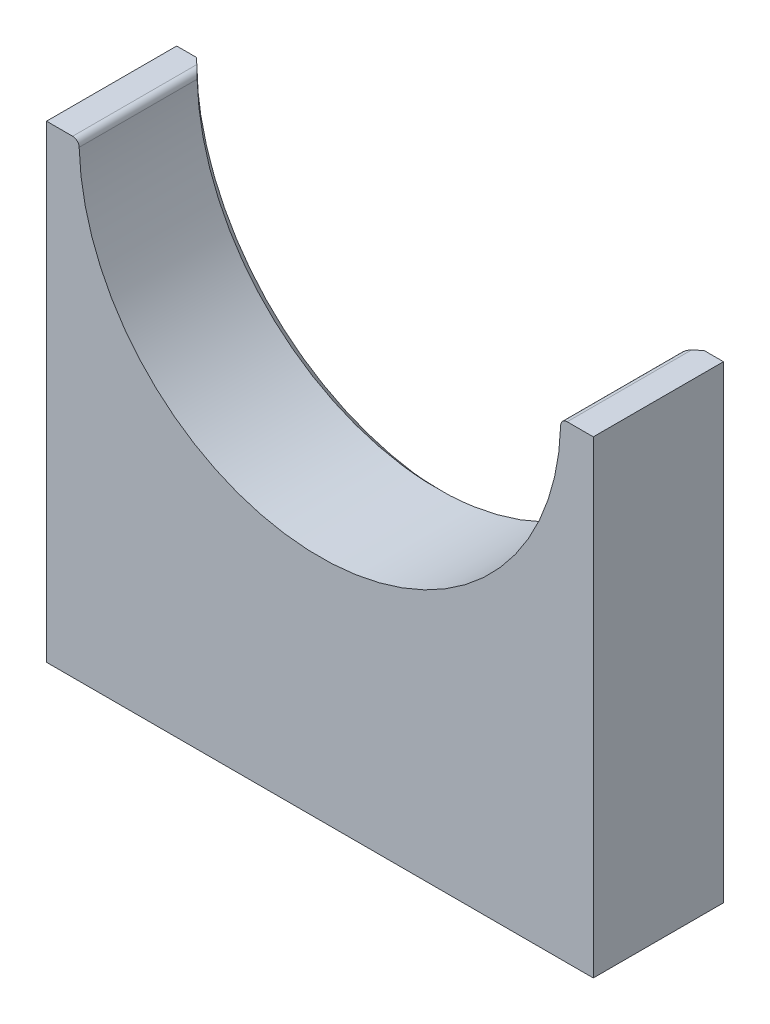
ISO-10303-21;
HEADER;
FILE_DESCRIPTION(('STEP AP214'),'2;1');
FILE_NAME('part.step','',(''),(''),'','','');
FILE_SCHEMA(('AUTOMOTIVE_DESIGN { 1 0 10303 214 1 1 1 1 }'));
ENDSEC;
DATA;
#1=APPLICATION_CONTEXT('core data for automotive mechanical design processes');
#2=APPLICATION_PROTOCOL_DEFINITION('international standard','automotive_design',2000,#1);
#3=PRODUCT_CONTEXT('',#1,'mechanical');
#4=PRODUCT('Part','Part','',(#3));
#5=PRODUCT_RELATED_PRODUCT_CATEGORY('part','',(#4));
#6=PRODUCT_DEFINITION_FORMATION('','',#4);
#7=PRODUCT_DEFINITION_CONTEXT('part definition',#1,'design');
#8=PRODUCT_DEFINITION('design','',#6,#7);
#9=PRODUCT_DEFINITION_SHAPE('','',#8);
#10=(LENGTH_UNIT() NAMED_UNIT(*) SI_UNIT(.MILLI.,.METRE.));
#11=(NAMED_UNIT(*) PLANE_ANGLE_UNIT() SI_UNIT($,.RADIAN.));
#12=(NAMED_UNIT(*) SI_UNIT($,.STERADIAN.) SOLID_ANGLE_UNIT());
#13=UNCERTAINTY_MEASURE_WITH_UNIT(LENGTH_MEASURE(1.E-05),#10,'distance_accuracy_value','');
#14=(GEOMETRIC_REPRESENTATION_CONTEXT(3) GLOBAL_UNCERTAINTY_ASSIGNED_CONTEXT((#13)) GLOBAL_UNIT_ASSIGNED_CONTEXT((#10,
#11,#12)) REPRESENTATION_CONTEXT('',''));
#15=CARTESIAN_POINT('',(0.,0.,0.));
#16=DIRECTION('',(0.,0.,1.));
#17=DIRECTION('',(1.,0.,0.));
#18=AXIS2_PLACEMENT_3D('',#15,#16,#17);
#19=CARTESIAN_POINT('',(106.68,-106.68,0.));
#20=DIRECTION('',(1.,0.,0.));
#21=DIRECTION('',(0.,0.,-1.));
#22=AXIS2_PLACEMENT_3D('',#19,#20,#21);
#23=PLANE('',#22);
#24=DIRECTION('',(0.,0.,-1.));
#25=VECTOR('',#24,1.);
#26=CARTESIAN_POINT('',(106.68,0.,0.));
#27=LINE('',#26,#25);
#28=CARTESIAN_POINT('',(106.68,0.,50.8));
#29=VERTEX_POINT('',#28);
#30=CARTESIAN_POINT('',(106.68,0.,0.));
#31=VERTEX_POINT('',#30);
#32=EDGE_CURVE('E120',#29,#31,#27,.T.);
#33=ORIENTED_EDGE('',*,*,#32,.F.);
#34=DIRECTION('',(0.,1.,0.));
#35=VECTOR('',#34,1.);
#36=CARTESIAN_POINT('',(106.68,-106.68,50.8));
#37=LINE('',#36,#35);
#38=CARTESIAN_POINT('',(106.68,-182.88,50.8));
#39=VERTEX_POINT('',#38);
#40=EDGE_CURVE('E115',#39,#29,#37,.T.);
#41=ORIENTED_EDGE('',*,*,#40,.F.);
#42=DIRECTION('',(0.,0.,1.));
#43=VECTOR('',#42,1.);
#44=CARTESIAN_POINT('',(106.68,-182.88,50.8));
#45=LINE('',#44,#43);
#46=CARTESIAN_POINT('',(106.68,-182.88,0.));
#47=VERTEX_POINT('',#46);
#48=EDGE_CURVE('E119',#47,#39,#45,.T.);
#49=ORIENTED_EDGE('',*,*,#48,.F.);
#50=DIRECTION('',(0.,1.,0.));
#51=VECTOR('',#50,1.);
#52=CARTESIAN_POINT('',(106.68,-106.68,0.));
#53=LINE('',#52,#51);
#54=EDGE_CURVE('E266',#47,#31,#53,.T.);
#55=ORIENTED_EDGE('',*,*,#54,.T.);
#56=EDGE_LOOP('',(#33,#41,#49,#55));
#57=FACE_BOUND('',#56,.T.);
#58=ADVANCED_FACE('F41',(#57),#23,.T.);
#59=CARTESIAN_POINT('',(-106.68,-106.68,0.));
#60=DIRECTION('',(-1.,0.,0.));
#61=DIRECTION('',(0.,0.,1.));
#62=AXIS2_PLACEMENT_3D('',#59,#60,#61);
#63=PLANE('',#62);
#64=DIRECTION('',(0.,0.,1.));
#65=VECTOR('',#64,1.);
#66=CARTESIAN_POINT('',(-106.68,0.,0.));
#67=LINE('',#66,#65);
#68=CARTESIAN_POINT('',(-106.68,0.,0.));
#69=VERTEX_POINT('',#68);
#70=CARTESIAN_POINT('',(-106.68,0.,50.8));
#71=VERTEX_POINT('',#70);
#72=EDGE_CURVE('E164',#69,#71,#67,.T.);
#73=ORIENTED_EDGE('',*,*,#72,.F.);
#74=DIRECTION('',(0.,-1.,0.));
#75=VECTOR('',#74,1.);
#76=CARTESIAN_POINT('',(-106.68,-106.68,0.));
#77=LINE('',#76,#75);
#78=CARTESIAN_POINT('',(-106.68,-182.88,0.));
#79=VERTEX_POINT('',#78);
#80=EDGE_CURVE('E268',#69,#79,#77,.T.);
#81=ORIENTED_EDGE('',*,*,#80,.T.);
#82=DIRECTION('',(0.,0.,-1.));
#83=VECTOR('',#82,1.);
#84=CARTESIAN_POINT('',(-106.68,-182.88,50.8));
#85=LINE('',#84,#83);
#86=CARTESIAN_POINT('',(-106.68,-182.88,50.8));
#87=VERTEX_POINT('',#86);
#88=EDGE_CURVE('E136',#87,#79,#85,.T.);
#89=ORIENTED_EDGE('',*,*,#88,.F.);
#90=DIRECTION('',(0.,-1.,0.));
#91=VECTOR('',#90,1.);
#92=CARTESIAN_POINT('',(-106.68,-106.68,50.8));
#93=LINE('',#92,#91);
#94=EDGE_CURVE('E124',#71,#87,#93,.T.);
#95=ORIENTED_EDGE('',*,*,#94,.F.);
#96=EDGE_LOOP('',(#73,#81,#89,#95));
#97=FACE_BOUND('',#96,.T.);
#98=ADVANCED_FACE('F241',(#97),#63,.T.);
#99=CARTESIAN_POINT('',(0.,0.,0.));
#100=DIRECTION('',(0.,0.,-1.));
#101=DIRECTION('',(-1.,0.,0.));
#102=AXIS2_PLACEMENT_3D('',#99,#100,#101);
#103=PLANE('',#102);
#104=DIRECTION('',(-1.,0.,0.));
#105=VECTOR('',#104,1.);
#106=CARTESIAN_POINT('',(0.,0.,0.));
#107=LINE('',#106,#105);
#108=CARTESIAN_POINT('',(99.060000898988,8.4741096414025E-12,0.));
#109=VERTEX_POINT('',#108);
#110=EDGE_CURVE('E152',#31,#109,#107,.T.);
#111=ORIENTED_EDGE('',*,*,#110,.F.);
#112=ORIENTED_EDGE('',*,*,#54,.F.);
#113=DIRECTION('',(1.,0.,0.));
#114=VECTOR('',#113,1.);
#115=CARTESIAN_POINT('',(106.68,-182.88,0.));
#116=LINE('',#115,#114);
#117=EDGE_CURVE('E141',#79,#47,#116,.T.);
#118=ORIENTED_EDGE('',*,*,#117,.F.);
#119=ORIENTED_EDGE('',*,*,#80,.F.);
#120=CARTESIAN_POINT('',(-99.06,0.,0.));
#121=VERTEX_POINT('',#120);
#122=EDGE_CURVE('E161',#121,#69,#107,.T.);
#123=ORIENTED_EDGE('',*,*,#122,.F.);
#124=CARTESIAN_POINT('',(0.,0.,0.));
#125=DIRECTION('',(0.,0.,1.));
#126=DIRECTION('',(1.,0.,0.));
#127=AXIS2_PLACEMENT_3D('',#124,#125,#126);
#128=CIRCLE('',#127,99.06);
#129=EDGE_CURVE('E168',#121,#109,#128,.T.);
#130=ORIENTED_EDGE('',*,*,#129,.T.);
#131=EDGE_LOOP('',(#111,#112,#118,#119,#123,#130));
#132=FACE_BOUND('',#131,.T.);
#133=ADVANCED_FACE('F244',(#132),#103,.T.);
#134=CARTESIAN_POINT('',(0.,0.,50.8));
#135=DIRECTION('',(0.,0.,-1.));
#136=DIRECTION('',(-1.,0.,0.));
#137=AXIS2_PLACEMENT_3D('',#134,#135,#136);
#138=PLANE('',#137);
#139=CARTESIAN_POINT('',(0.,0.,50.8));
#140=DIRECTION('',(0.,0.,1.));
#141=DIRECTION('',(1.,0.,0.));
#142=AXIS2_PLACEMENT_3D('',#139,#140,#141);
#143=CIRCLE('',#142,93.98);
#144=CARTESIAN_POINT('',(-93.9474528128767,-2.47315789473684,50.8));
#145=VERTEX_POINT('',#144);
#146=CARTESIAN_POINT('',(93.9474528128767,-2.47315789473684,50.8));
#147=VERTEX_POINT('',#146);
#148=EDGE_CURVE('E125',#145,#147,#143,.T.);
#149=ORIENTED_EDGE('',*,*,#148,.F.);
#150=CARTESIAN_POINT('',(-96.4865731591707,-2.54,50.8));
#151=DIRECTION('',(0.,0.,-1.));
#152=DIRECTION('',(-1.,0.,0.));
#153=AXIS2_PLACEMENT_3D('',#150,#151,#152);
#154=CIRCLE('',#153,2.54);
#155=CARTESIAN_POINT('',(-96.4865731591707,0.,50.8));
#156=VERTEX_POINT('',#155);
#157=EDGE_CURVE('E294',#145,#156,#154,.F.);
#158=ORIENTED_EDGE('',*,*,#157,.T.);
#159=DIRECTION('',(-1.,0.,0.));
#160=VECTOR('',#159,1.);
#161=CARTESIAN_POINT('',(0.,0.,50.8));
#162=LINE('',#161,#160);
#163=EDGE_CURVE('E153',#156,#71,#162,.T.);
#164=ORIENTED_EDGE('',*,*,#163,.T.);
#165=ORIENTED_EDGE('',*,*,#94,.T.);
#166=DIRECTION('',(-1.,0.,0.));
#167=VECTOR('',#166,1.);
#168=CARTESIAN_POINT('',(106.68,-182.88,50.8));
#169=LINE('',#168,#167);
#170=EDGE_CURVE('E128',#39,#87,#169,.T.);
#171=ORIENTED_EDGE('',*,*,#170,.F.);
#172=ORIENTED_EDGE('',*,*,#40,.T.);
#173=CARTESIAN_POINT('',(96.4865731591707,0.,50.8));
#174=VERTEX_POINT('',#173);
#175=EDGE_CURVE('E149',#29,#174,#162,.T.);
#176=ORIENTED_EDGE('',*,*,#175,.T.);
#177=CARTESIAN_POINT('',(96.4865731591707,-2.54,50.8));
#178=DIRECTION('',(0.,0.,-1.));
#179=DIRECTION('',(-1.,0.,0.));
#180=AXIS2_PLACEMENT_3D('',#177,#178,#179);
#181=CIRCLE('',#180,2.54);
#182=EDGE_CURVE('E284',#174,#147,#181,.F.);
#183=ORIENTED_EDGE('',*,*,#182,.T.);
#184=EDGE_LOOP('',(#149,#158,#164,#165,#171,#172,#176,#183));
#185=FACE_BOUND('',#184,.T.);
#186=ADVANCED_FACE('F130',(#185),#138,.F.);
#187=CARTESIAN_POINT('',(0.,0.,0.));
#188=DIRECTION('',(0.,0.,1.));
#189=DIRECTION('',(1.,0.,0.));
#190=AXIS2_PLACEMENT_3D('',#187,#188,#189);
#191=CYLINDRICAL_SURFACE('',#190,93.98);
#192=CARTESIAN_POINT('',(0.,0.,4.77022595576423));
#193=DIRECTION('',(0.,0.,1.));
#194=DIRECTION('',(1.,0.,0.));
#195=AXIS2_PLACEMENT_3D('',#192,#193,#194);
#196=CIRCLE('',#195,93.98);
#197=CARTESIAN_POINT('',(93.9474528128767,-2.47315789473684,4.77022595576423));
#198=VERTEX_POINT('',#197);
#199=CARTESIAN_POINT('',(-93.9474528128767,-2.47315789473684,4.77022595576423));
#200=VERTEX_POINT('',#199);
#201=EDGE_CURVE('E261',#198,#200,#196,.F.);
#202=ORIENTED_EDGE('',*,*,#201,.T.);
#203=DIRECTION('',(0.,0.,1.));
#204=VECTOR('',#203,1.);
#205=CARTESIAN_POINT('',(-93.9474528128767,-2.47315789473684,0.));
#206=LINE('',#205,#204);
#207=EDGE_CURVE('E280',#200,#145,#206,.T.);
#208=ORIENTED_EDGE('',*,*,#207,.T.);
#209=ORIENTED_EDGE('',*,*,#148,.T.);
#210=DIRECTION('',(0.,0.,1.));
#211=VECTOR('',#210,1.);
#212=CARTESIAN_POINT('',(93.9474528128767,-2.47315789473684,0.));
#213=LINE('',#212,#211);
#214=EDGE_CURVE('E278',#147,#198,#213,.F.);
#215=ORIENTED_EDGE('',*,*,#214,.T.);
#216=EDGE_LOOP('',(#202,#208,#209,#215));
#217=FACE_BOUND('',#216,.T.);
#218=ADVANCED_FACE('F191',(#217),#191,.F.);
#219=CARTESIAN_POINT('',(-5.22583665885806,98.9220613979255,0.));
#220=CARTESIAN_POINT('',(82.0692055030363,45.7917668156667,50.8));
#221=CARTESIAN_POINT('',(-203.069959454709,88.4703880802093,0.));
#222=CARTESIAN_POINT('',(-9.51432812829715,209.930177821739,50.8));
#223=CARTESIAN_POINT('',(-192.618286136993,-109.373734715642,0.));
#224=CARTESIAN_POINT('',(-173.65273913437,118.346644190406,50.8));
#225=CARTESIAN_POINT('',(5.22583665885805,-98.9220613979255,0.));
#226=CARTESIAN_POINT('',(-82.0692055030363,-45.7917668156667,50.8));
#227=CARTESIAN_POINT('',(203.069959454709,-88.4703880802094,0.));
#228=CARTESIAN_POINT('',(9.51432812829715,-209.930177821739,50.8));
#229=CARTESIAN_POINT('',(192.618286136993,109.373734715642,0.));
#230=CARTESIAN_POINT('',(173.65273913437,-118.346644190406,50.8));
#231=CARTESIAN_POINT('',(-5.22583665885806,98.9220613979255,0.));
#232=CARTESIAN_POINT('',(82.0692055030363,45.7917668156667,50.8));
#233=(BOUNDED_SURFACE() B_SPLINE_SURFACE(3,1,((#219,#220),(#221,#222),(#223,#224),(#225,#226),
(#227,#228),(#229,#230),(#231,#232)),.UNSPECIFIED.,.T.,.F.,.F.) B_SPLINE_SURFACE_WITH_KNOTS((4,
3,4),(2,2),(0.,0.5,1.),(0.,1.),
.UNSPECIFIED.) GEOMETRIC_REPRESENTATION_ITEM() RATIONAL_B_SPLINE_SURFACE(((1.,1.),
(0.333333333333333,0.333333333333333),(0.333333333333333,0.333333333333333),(1.,1.),
(0.333333333333333,0.333333333333333),(0.333333333333333,0.333333333333333),(1.,1.))) REPRESENTATION_ITEM('') SURFACE());
#234=CARTESIAN_POINT('',(-99.06,0.,0.));
#235=CARTESIAN_POINT('',(-98.8420415564241,0.,0.192023565351599));
#236=CARTESIAN_POINT('',(-98.6247542611355,0.,0.384810081436057));
#237=CARTESIAN_POINT('',(-98.191641019553,0.,0.771931527221112));
#238=CARTESIAN_POINT('',(-97.9758147922164,0.,0.966266142524899));
#239=CARTESIAN_POINT('',(-97.5456871295782,0.,1.35655437710607));
#240=CARTESIAN_POINT('',(-97.3313854801418,0.,1.552507760316));
#241=CARTESIAN_POINT('',(-96.904376188475,0.,1.94610967369235));
#242=CARTESIAN_POINT('',(-96.6916684191595,0.,2.14375806595662));
#243=CARTESIAN_POINT('',(-96.2679132721635,0.,2.54083784763829));
#244=CARTESIAN_POINT('',(-96.0568659359386,0.,2.7402692813086));
#245=CARTESIAN_POINT('',(-95.6365205364005,0.,3.14099307641488));
#246=CARTESIAN_POINT('',(-95.4272225801195,0.,3.34228555015067));
#247=CARTESIAN_POINT('',(-95.0104629208144,0.,3.7468214264179));
#248=CARTESIAN_POINT('',(-94.8030014789203,0.,3.95006509808633));
#249=CARTESIAN_POINT('',(-94.3900106012508,0.,4.35860085026798));
#250=CARTESIAN_POINT('',(-94.1844816240633,0.,4.56389339429799));
#251=CARTESIAN_POINT('',(-93.98,0.,4.77022595576423));
#252=B_SPLINE_CURVE_WITH_KNOTS('',3,(#234,#235,#236,#237,#238,#239,#240,#241,#242,#243,#244,
#245,#246,#247,#248,#249,#250,#251),.UNSPECIFIED.,.F.,.F.,(4,2,2,2,2,2,2,2,4),(0.,
0.871440911790066,1.742709142632,2.61385248247416,3.48492560799787,4.35602041284292,
5.2271681293328,6.0984377845629,6.96990922896814),.UNSPECIFIED.);
#253=CARTESIAN_POINT('',(-96.4865731591707,0.,2.33594315915091));
#254=VERTEX_POINT('',#253);
#255=EDGE_CURVE('E286',#121,#254,#252,.T.);
#256=CARTESIAN_POINT('',(-96.4865731591707,0.,2.33594315915092));
#257=CARTESIAN_POINT('',(-96.3907783816814,-2.28734198966048E-05,2.4256863367287));
#258=CARTESIAN_POINT('',(-96.2951557438185,-0.0054204631764299,2.51561959757531));
#259=CARTESIAN_POINT('',(-96.1048050487047,-0.0270198857876057,2.69532843631234));
#260=CARTESIAN_POINT('',(-96.0100780027566,-0.0432327268632509,2.78510376000471));
#261=CARTESIAN_POINT('',(-95.82142662309,-0.0867112280092524,2.96457256375114));
#262=CARTESIAN_POINT('',(-95.7275170525504,-0.114074473477392,3.05425812613927));
#263=CARTESIAN_POINT('',(-95.5421671763655,-0.180048708924797,3.23191646792834));
#264=CARTESIAN_POINT('',(-95.4507256393181,-0.218653972050118,3.31989009513243));
#265=CARTESIAN_POINT('',(-95.228172826037,-0.328672477694684,3.53472248905243));
#266=CARTESIAN_POINT('',(-95.0989425252194,-0.406951492065627,3.66011496173031));
#267=CARTESIAN_POINT('',(-94.8513966790954,-0.590275246293499,3.901204769233));
#268=CARTESIAN_POINT('',(-94.7330468498244,-0.695231694108387,4.01693244392788));
#269=CARTESIAN_POINT('',(-94.5427887194575,-0.90075882838026,4.20320576014691));
#270=CARTESIAN_POINT('',(-94.4670929117637,-0.994502611456122,4.27739118243087));
#271=CARTESIAN_POINT('',(-94.3268837415952,-1.19742865543148,4.41458235847555));
#272=CARTESIAN_POINT('',(-94.2623585958944,-1.30659442509418,4.47759989421689));
#273=CARTESIAN_POINT('',(-94.1599755272071,-1.51570466255616,4.5769383728503));
#274=CARTESIAN_POINT('',(-94.119362463698,-1.61294669783869,4.61608392750956));
#275=CARTESIAN_POINT('',(-94.0498143344169,-1.8153035925336,4.68226696532161));
#276=CARTESIAN_POINT('',(-94.0208522919404,-1.92039958944052,4.70933243474053));
#277=CARTESIAN_POINT('',(-93.9837881747674,-2.10052418485804,4.74275839186404));
#278=CARTESIAN_POINT('',(-93.9719587380808,-2.17408404923659,4.75300012445085));
#279=CARTESIAN_POINT('',(-93.9590740429289,-2.28553245291593,4.76330435891457));
#280=CARTESIAN_POINT('',(-93.9555874502478,-2.32292512996336,4.76589611518262));
#281=CARTESIAN_POINT('',(-93.9502707809998,-2.3979210806584,4.76935845340214));
#282=CARTESIAN_POINT('',(-93.9484413153444,-2.43552442683455,4.77022840073645));
#283=CARTESIAN_POINT('',(-93.9474528128768,-2.47315789473685,4.77022595576424));
#284=B_SPLINE_CURVE_WITH_KNOTS('',3,(#256,#257,#258,#259,#260,#261,#262,#263,#264,#265,#266,
#267,#268,#269,#270,#271,#272,#273,#274,#275,#276,#277,#278,#279,#280,#281,#282,#283),
.UNSPECIFIED.,.F.,.F.,(4,2,2,2,2,2,2,2,2,2,2,2,2,4),(0.,0.393691183311433,0.787783694854728,
1.18540191939596,1.58281794447385,2.16978336088005,2.75483088320148,3.1779448337119,
3.60060971197725,3.93656756447468,4.27174300205018,4.49677265923884,4.60963563127643,
4.72254019413725),.UNSPECIFIED.);
#285=EDGE_CURVE('E51',#254,#200,#284,.T.);
#286=CARTESIAN_POINT('',(93.9474528128767,-2.47315789473684,4.77022595576423));
#287=CARTESIAN_POINT('',(93.9489291401898,-2.41651911682494,4.77024218393827));
#288=CARTESIAN_POINT('',(93.9523290599421,-2.35994312111087,4.76826189081975));
#289=CARTESIAN_POINT('',(93.9628484133792,-2.24745641307316,4.76043328936199));
#290=CARTESIAN_POINT('',(93.9699645789687,-2.19154516028355,4.75458837839779));
#291=CARTESIAN_POINT('',(93.9877104386483,-2.08133167085285,4.73922558560946));
#292=CARTESIAN_POINT('',(93.9983074772912,-2.02701940710691,4.72974170836603));
#293=CARTESIAN_POINT('',(94.0228194227348,-1.9198858562407,4.70732000686794));
#294=CARTESIAN_POINT('',(94.036734877778,-1.86706481710315,4.69438161184296));
#295=CARTESIAN_POINT('',(94.0830007413739,-1.71171423567033,4.65085893163281));
#296=CARTESIAN_POINT('',(94.1199488683891,-1.61182945713453,4.6154986834326));
#297=CARTESIAN_POINT('',(94.2040026290788,-1.42088262943083,4.53431734624686));
#298=CARTESIAN_POINT('',(94.2511333277324,-1.32984316990191,4.48847042707676));
#299=CARTESIAN_POINT('',(94.3759005534837,-1.11963986223858,4.36670398851872));
#300=CARTESIAN_POINT('',(94.4578658573818,-1.00557987745164,4.28639973708225));
#301=CARTESIAN_POINT('',(94.6337293162669,-0.797232154888076,4.11415452586312));
#302=CARTESIAN_POINT('',(94.7276504756688,-0.702983488580931,4.0221911340007));
#303=CARTESIAN_POINT('',(94.9614639032409,-0.500938167908489,3.79385283366979));
#304=CARTESIAN_POINT('',(95.1052325718967,-0.401672116667926,3.65391155073541));
#305=CARTESIAN_POINT('',(95.4030688562071,-0.236375634609102,3.36565026919413));
#306=CARTESIAN_POINT('',(95.557151569847,-0.170395188969929,3.2173180391234));
#307=CARTESIAN_POINT('',(95.8405567685684,-0.0799606386701698,2.94624295942536));
#308=CARTESIAN_POINT('',(95.968793307193,-0.0498934552733968,2.82420092906747));
#309=CARTESIAN_POINT('',(96.1624414085361,-0.0199256720264858,2.64087877685973));
#310=CARTESIAN_POINT('',(96.2270327028884,-0.0124585234292448,2.57989087722398));
#311=CARTESIAN_POINT('',(96.3565765625072,-0.00249844768752199,2.45789198706339));
#312=CARTESIAN_POINT('',(96.4215291289541,-5.53680555431266E-06,2.39688099646371));
#313=CARTESIAN_POINT('',(96.4865731591707,0.,2.3359431591509));
#314=B_SPLINE_CURVE_WITH_KNOTS('',3,(#286,#287,#288,#289,#290,#291,#292,#293,#294,#295,#296,
#297,#298,#299,#300,#301,#302,#303,#304,#305,#306,#307,#308,#309,#310,#311,#312,#313),
.UNSPECIFIED.,.F.,.F.,(4,2,2,2,2,2,2,2,2,2,2,2,2,4),(0.,0.16988757443849,0.339625999386691,
0.507815469529214,0.676032745875542,1.01104920888532,1.34689992569336,1.82957292463732,
2.31318909060348,2.98115557737312,3.65012218923543,4.18760227381058,4.45492303214249,
4.72224466443755),.UNSPECIFIED.);
#315=CARTESIAN_POINT('',(96.4865731591707,0.,2.33594315915089));
#316=VERTEX_POINT('',#315);
#317=EDGE_CURVE('E58',#198,#316,#314,.T.);
#318=CARTESIAN_POINT('',(93.98,0.,4.77022595576422));
#319=CARTESIAN_POINT('',(94.1844816240634,0.,4.56389339429798));
#320=CARTESIAN_POINT('',(94.3900106012509,0.,4.35860085026797));
#321=CARTESIAN_POINT('',(94.8030014789203,0.,3.95006509808631));
#322=CARTESIAN_POINT('',(95.0104629208144,0.,3.74682142641787));
#323=CARTESIAN_POINT('',(95.4272225801195,0.,3.34228555015063));
#324=CARTESIAN_POINT('',(95.6365205364005,0.,3.14099307641486));
#325=CARTESIAN_POINT('',(96.0568659359386,0.,2.74026928130858));
#326=CARTESIAN_POINT('',(96.2679132721635,0.,2.54083784763825));
#327=CARTESIAN_POINT('',(96.6916684191595,0.,2.14375806595659));
#328=CARTESIAN_POINT('',(96.9043761884749,0.,1.94610967369234));
#329=CARTESIAN_POINT('',(97.3313854801418,0.,1.552507760316));
#330=CARTESIAN_POINT('',(97.5456871295782,0.,1.35655437710608));
#331=CARTESIAN_POINT('',(97.9758147922163,0.,0.966266142524903));
#332=CARTESIAN_POINT('',(98.1916410195529,0.,0.771931527221111));
#333=CARTESIAN_POINT('',(98.6247542611355,0.,0.384810081436048));
#334=CARTESIAN_POINT('',(98.842041556424,0.,0.192023565351587));
#335=CARTESIAN_POINT('',(99.06,0.,0.));
#336=B_SPLINE_CURVE_WITH_KNOTS('',3,(#318,#319,#320,#321,#322,#323,#324,#325,#326,#327,#328,
#329,#330,#331,#332,#333,#334,#335),.UNSPECIFIED.,.F.,.F.,(4,2,2,2,2,2,2,2,4),(0.,
0.87147144440522,1.74274109963534,2.6138888161252,3.48498362097025,4.35605674649394,
5.22720008633611,6.09846831717803,6.96990922896811),.UNSPECIFIED.);
#337=EDGE_CURVE('E226',#316,#109,#336,.T.);
#338=ORIENTED_EDGE('',*,*,#255,.T.);
#339=ORIENTED_EDGE('',*,*,#285,.T.);
#340=ORIENTED_EDGE('',*,*,#201,.F.);
#341=ORIENTED_EDGE('',*,*,#317,.T.);
#342=ORIENTED_EDGE('',*,*,#337,.T.);
#343=ORIENTED_EDGE('',*,*,#129,.F.);
#344=EDGE_LOOP('',(#338,#339,#340,#341,#342,#343));
#345=FACE_BOUND('',#344,.T.);
#346=ADVANCED_FACE('F178',(#345),#233,.F.);
#347=CARTESIAN_POINT('',(0.,0.,0.));
#348=DIRECTION('',(0.,-1.,0.));
#349=DIRECTION('',(0.,0.,-1.));
#350=AXIS2_PLACEMENT_3D('',#347,#348,#349);
#351=PLANE('',#350);
#352=ORIENTED_EDGE('',*,*,#337,.F.);
#353=DIRECTION('',(0.,0.,1.));
#354=VECTOR('',#353,1.);
#355=CARTESIAN_POINT('',(96.4865731591707,0.,0.));
#356=LINE('',#355,#354);
#357=EDGE_CURVE('E12',#316,#174,#356,.T.);
#358=ORIENTED_EDGE('',*,*,#357,.T.);
#359=ORIENTED_EDGE('',*,*,#175,.F.);
#360=ORIENTED_EDGE('',*,*,#32,.T.);
#361=ORIENTED_EDGE('',*,*,#110,.T.);
#362=EDGE_LOOP('',(#352,#358,#359,#360,#361));
#363=FACE_BOUND('',#362,.T.);
#364=ADVANCED_FACE('F190',(#363),#351,.F.);
#365=ORIENTED_EDGE('',*,*,#163,.F.);
#366=DIRECTION('',(0.,0.,1.));
#367=VECTOR('',#366,1.);
#368=CARTESIAN_POINT('',(-96.4865731591707,0.,0.));
#369=LINE('',#368,#367);
#370=EDGE_CURVE('E66',#156,#254,#369,.F.);
#371=ORIENTED_EDGE('',*,*,#370,.T.);
#372=ORIENTED_EDGE('',*,*,#255,.F.);
#373=ORIENTED_EDGE('',*,*,#122,.T.);
#374=ORIENTED_EDGE('',*,*,#72,.T.);
#375=EDGE_LOOP('',(#365,#371,#372,#373,#374));
#376=FACE_BOUND('',#375,.T.);
#377=ADVANCED_FACE('F237',(#376),#351,.F.);
#378=CARTESIAN_POINT('',(-96.4865731591707,-2.54,0.));
#379=DIRECTION('',(0.,0.,1.));
#380=DIRECTION('',(1.,0.,0.));
#381=AXIS2_PLACEMENT_3D('',#378,#379,#380);
#382=CYLINDRICAL_SURFACE('',#381,2.54);
#383=ORIENTED_EDGE('',*,*,#285,.F.);
#384=ORIENTED_EDGE('',*,*,#370,.F.);
#385=ORIENTED_EDGE('',*,*,#157,.F.);
#386=ORIENTED_EDGE('',*,*,#207,.F.);
#387=EDGE_LOOP('',(#383,#384,#385,#386));
#388=FACE_BOUND('',#387,.T.);
#389=ADVANCED_FACE('F233',(#388),#382,.T.);
#390=CARTESIAN_POINT('',(96.4865731591707,-2.54,0.));
#391=DIRECTION('',(0.,0.,1.));
#392=DIRECTION('',(1.,0.,0.));
#393=AXIS2_PLACEMENT_3D('',#390,#391,#392);
#394=CYLINDRICAL_SURFACE('',#393,2.54);
#395=ORIENTED_EDGE('',*,*,#182,.F.);
#396=ORIENTED_EDGE('',*,*,#357,.F.);
#397=ORIENTED_EDGE('',*,*,#317,.F.);
#398=ORIENTED_EDGE('',*,*,#214,.F.);
#399=EDGE_LOOP('',(#395,#396,#397,#398));
#400=FACE_BOUND('',#399,.T.);
#401=ADVANCED_FACE('F43',(#400),#394,.T.);
#402=CARTESIAN_POINT('',(0.,-182.88,0.));
#403=DIRECTION('',(0.,1.,0.));
#404=DIRECTION('',(0.,0.,1.));
#405=AXIS2_PLACEMENT_3D('',#402,#403,#404);
#406=PLANE('',#405);
#407=ORIENTED_EDGE('',*,*,#48,.T.);
#408=ORIENTED_EDGE('',*,*,#170,.T.);
#409=ORIENTED_EDGE('',*,*,#88,.T.);
#410=ORIENTED_EDGE('',*,*,#117,.T.);
#411=EDGE_LOOP('',(#407,#408,#409,#410));
#412=FACE_BOUND('',#411,.T.);
#413=ADVANCED_FACE('F139',(#412),#406,.F.);
#414=CLOSED_SHELL('',(#58,#98,#133,#186,#218,#346,#364,#377,#389,#401,#413));
#415=MANIFOLD_SOLID_BREP('B2',#414);
#416=ADVANCED_BREP_SHAPE_REPRESENTATION('',(#18,#415),#14);
#417=SHAPE_DEFINITION_REPRESENTATION(#9,#416);
ENDSEC;
END-ISO-10303-21;
